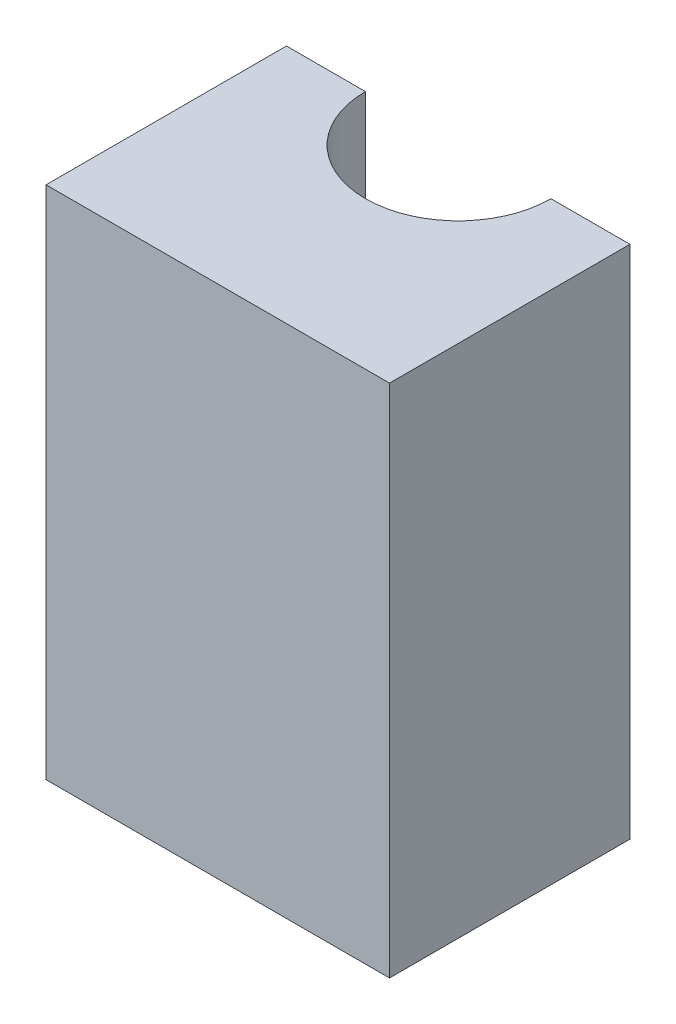
ISO-10303-21;
HEADER;
FILE_DESCRIPTION(('STEP AP214'),'2;1');
FILE_NAME('part.step','',(''),(''),'','','');
FILE_SCHEMA(('AUTOMOTIVE_DESIGN { 1 0 10303 214 1 1 1 1 }'));
ENDSEC;
DATA;
#1=APPLICATION_CONTEXT('core data for automotive mechanical design processes');
#2=APPLICATION_PROTOCOL_DEFINITION('international standard','automotive_design',2000,#1);
#3=PRODUCT_CONTEXT('',#1,'mechanical');
#4=PRODUCT('Part','Part','',(#3));
#5=PRODUCT_RELATED_PRODUCT_CATEGORY('part','',(#4));
#6=PRODUCT_DEFINITION_FORMATION('','',#4);
#7=PRODUCT_DEFINITION_CONTEXT('part definition',#1,'design');
#8=PRODUCT_DEFINITION('design','',#6,#7);
#9=PRODUCT_DEFINITION_SHAPE('','',#8);
#10=(LENGTH_UNIT() NAMED_UNIT(*) SI_UNIT(.MILLI.,.METRE.));
#11=(NAMED_UNIT(*) PLANE_ANGLE_UNIT() SI_UNIT($,.RADIAN.));
#12=(NAMED_UNIT(*) SI_UNIT($,.STERADIAN.) SOLID_ANGLE_UNIT());
#13=UNCERTAINTY_MEASURE_WITH_UNIT(LENGTH_MEASURE(1.E-05),#10,'distance_accuracy_value','');
#14=(GEOMETRIC_REPRESENTATION_CONTEXT(3) GLOBAL_UNCERTAINTY_ASSIGNED_CONTEXT((#13)) GLOBAL_UNIT_ASSIGNED_CONTEXT((#10,
#11,#12)) REPRESENTATION_CONTEXT('',''));
#15=CARTESIAN_POINT('',(0.,0.,0.));
#16=DIRECTION('',(0.,0.,1.));
#17=DIRECTION('',(1.,0.,0.));
#18=AXIS2_PLACEMENT_3D('',#15,#16,#17);
#19=CARTESIAN_POINT('',(5.,15.,3.5));
#20=DIRECTION('',(-1.,0.,0.));
#21=DIRECTION('',(0.,0.,1.));
#22=AXIS2_PLACEMENT_3D('',#19,#20,#21);
#23=PLANE('',#22);
#24=DIRECTION('',(0.,0.,-1.));
#25=VECTOR('',#24,1.);
#26=CARTESIAN_POINT('',(5.,0.,3.5));
#27=LINE('',#26,#25);
#28=CARTESIAN_POINT('',(5.,0.,3.5));
#29=VERTEX_POINT('',#28);
#30=CARTESIAN_POINT('',(5.,0.,-3.5));
#31=VERTEX_POINT('',#30);
#32=EDGE_CURVE('E117',#29,#31,#27,.T.);
#33=ORIENTED_EDGE('',*,*,#32,.T.);
#34=DIRECTION('',(0.,-1.,0.));
#35=VECTOR('',#34,1.);
#36=CARTESIAN_POINT('',(5.,15.,-3.5));
#37=LINE('',#36,#35);
#38=CARTESIAN_POINT('',(5.,15.,-3.5));
#39=VERTEX_POINT('',#38);
#40=EDGE_CURVE('E11',#39,#31,#37,.T.);
#41=ORIENTED_EDGE('',*,*,#40,.F.);
#42=DIRECTION('',(0.,0.,-1.));
#43=VECTOR('',#42,1.);
#44=CARTESIAN_POINT('',(5.,15.,3.5));
#45=LINE('',#44,#43);
#46=CARTESIAN_POINT('',(5.,15.,3.5));
#47=VERTEX_POINT('',#46);
#48=EDGE_CURVE('E127',#47,#39,#45,.T.);
#49=ORIENTED_EDGE('',*,*,#48,.F.);
#50=DIRECTION('',(0.,-1.,0.));
#51=VECTOR('',#50,1.);
#52=CARTESIAN_POINT('',(5.,15.,3.5));
#53=LINE('',#52,#51);
#54=EDGE_CURVE('E113',#47,#29,#53,.T.);
#55=ORIENTED_EDGE('',*,*,#54,.T.);
#56=EDGE_LOOP('',(#33,#41,#49,#55));
#57=FACE_BOUND('',#56,.T.);
#58=ADVANCED_FACE('F33',(#57),#23,.F.);
#59=CARTESIAN_POINT('',(2.7,15.,-3.5));
#60=DIRECTION('',(0.,0.,1.));
#61=DIRECTION('',(1.,0.,0.));
#62=AXIS2_PLACEMENT_3D('',#59,#60,#61);
#63=PLANE('',#62);
#64=DIRECTION('',(-1.,0.,0.));
#65=VECTOR('',#64,1.);
#66=CARTESIAN_POINT('',(2.7,0.,-3.5));
#67=LINE('',#66,#65);
#68=CARTESIAN_POINT('',(2.7,0.,-3.5));
#69=VERTEX_POINT('',#68);
#70=EDGE_CURVE('E120',#31,#69,#67,.T.);
#71=ORIENTED_EDGE('',*,*,#70,.T.);
#72=DIRECTION('',(0.,-1.,0.));
#73=VECTOR('',#72,1.);
#74=CARTESIAN_POINT('',(2.7,15.,-3.5));
#75=LINE('',#74,#73);
#76=CARTESIAN_POINT('',(2.7,15.,-3.5));
#77=VERTEX_POINT('',#76);
#78=EDGE_CURVE('E41',#77,#69,#75,.T.);
#79=ORIENTED_EDGE('',*,*,#78,.F.);
#80=DIRECTION('',(-1.,0.,0.));
#81=VECTOR('',#80,1.);
#82=CARTESIAN_POINT('',(2.7,15.,-3.5));
#83=LINE('',#82,#81);
#84=EDGE_CURVE('E86',#39,#77,#83,.T.);
#85=ORIENTED_EDGE('',*,*,#84,.F.);
#86=ORIENTED_EDGE('',*,*,#40,.T.);
#87=EDGE_LOOP('',(#71,#79,#85,#86));
#88=FACE_BOUND('',#87,.T.);
#89=ADVANCED_FACE('F151',(#88),#63,.F.);
#90=CARTESIAN_POINT('',(0.,15.,-3.5));
#91=DIRECTION('',(0.,-1.,0.));
#92=DIRECTION('',(0.,0.,-1.));
#93=AXIS2_PLACEMENT_3D('',#90,#91,#92);
#94=CYLINDRICAL_SURFACE('',#93,2.7);
#95=CARTESIAN_POINT('',(0.,0.,-3.5));
#96=DIRECTION('',(0.,-1.,0.));
#97=DIRECTION('',(0.,0.,1.));
#98=AXIS2_PLACEMENT_3D('',#95,#96,#97);
#99=CIRCLE('',#98,2.7);
#100=CARTESIAN_POINT('',(-2.7,0.,-3.5));
#101=VERTEX_POINT('',#100);
#102=EDGE_CURVE('E122',#69,#101,#99,.T.);
#103=ORIENTED_EDGE('',*,*,#102,.T.);
#104=DIRECTION('',(0.,-1.,0.));
#105=VECTOR('',#104,1.);
#106=CARTESIAN_POINT('',(-2.7,15.,-3.5));
#107=LINE('',#106,#105);
#108=CARTESIAN_POINT('',(-2.7,15.,-3.5));
#109=VERTEX_POINT('',#108);
#110=EDGE_CURVE('E108',#109,#101,#107,.T.);
#111=ORIENTED_EDGE('',*,*,#110,.F.);
#112=CARTESIAN_POINT('',(0.,15.,-3.5));
#113=DIRECTION('',(0.,-1.,0.));
#114=DIRECTION('',(0.,0.,1.));
#115=AXIS2_PLACEMENT_3D('',#112,#113,#114);
#116=CIRCLE('',#115,2.7);
#117=EDGE_CURVE('E99',#77,#109,#116,.T.);
#118=ORIENTED_EDGE('',*,*,#117,.F.);
#119=ORIENTED_EDGE('',*,*,#78,.T.);
#120=EDGE_LOOP('',(#103,#111,#118,#119));
#121=FACE_BOUND('',#120,.T.);
#122=ADVANCED_FACE('F133',(#121),#94,.F.);
#123=CARTESIAN_POINT('',(-5.,15.,-3.5));
#124=DIRECTION('',(0.,0.,1.));
#125=DIRECTION('',(1.,0.,0.));
#126=AXIS2_PLACEMENT_3D('',#123,#124,#125);
#127=PLANE('',#126);
#128=DIRECTION('',(-1.,0.,0.));
#129=VECTOR('',#128,1.);
#130=CARTESIAN_POINT('',(-5.,0.,-3.5));
#131=LINE('',#130,#129);
#132=CARTESIAN_POINT('',(-5.,0.,-3.5));
#133=VERTEX_POINT('',#132);
#134=EDGE_CURVE('E107',#101,#133,#131,.T.);
#135=ORIENTED_EDGE('',*,*,#134,.T.);
#136=DIRECTION('',(0.,-1.,0.));
#137=VECTOR('',#136,1.);
#138=CARTESIAN_POINT('',(-5.,15.,-3.5));
#139=LINE('',#138,#137);
#140=CARTESIAN_POINT('',(-5.,15.,-3.5));
#141=VERTEX_POINT('',#140);
#142=EDGE_CURVE('E104',#141,#133,#139,.T.);
#143=ORIENTED_EDGE('',*,*,#142,.F.);
#144=DIRECTION('',(-1.,0.,0.));
#145=VECTOR('',#144,1.);
#146=CARTESIAN_POINT('',(-5.,15.,-3.5));
#147=LINE('',#146,#145);
#148=EDGE_CURVE('E93',#109,#141,#147,.T.);
#149=ORIENTED_EDGE('',*,*,#148,.F.);
#150=ORIENTED_EDGE('',*,*,#110,.T.);
#151=EDGE_LOOP('',(#135,#143,#149,#150));
#152=FACE_BOUND('',#151,.T.);
#153=ADVANCED_FACE('F105',(#152),#127,.F.);
#154=CARTESIAN_POINT('',(-5.,15.,3.5));
#155=DIRECTION('',(1.,0.,0.));
#156=DIRECTION('',(0.,0.,-1.));
#157=AXIS2_PLACEMENT_3D('',#154,#155,#156);
#158=PLANE('',#157);
#159=DIRECTION('',(0.,0.,1.));
#160=VECTOR('',#159,1.);
#161=CARTESIAN_POINT('',(-5.,0.,3.5));
#162=LINE('',#161,#160);
#163=CARTESIAN_POINT('',(-5.,0.,3.5));
#164=VERTEX_POINT('',#163);
#165=EDGE_CURVE('E72',#133,#164,#162,.T.);
#166=ORIENTED_EDGE('',*,*,#165,.T.);
#167=DIRECTION('',(0.,-1.,0.));
#168=VECTOR('',#167,1.);
#169=CARTESIAN_POINT('',(-5.,15.,3.5));
#170=LINE('',#169,#168);
#171=CARTESIAN_POINT('',(-5.,15.,3.5));
#172=VERTEX_POINT('',#171);
#173=EDGE_CURVE('E109',#172,#164,#170,.T.);
#174=ORIENTED_EDGE('',*,*,#173,.F.);
#175=DIRECTION('',(0.,0.,1.));
#176=VECTOR('',#175,1.);
#177=CARTESIAN_POINT('',(-5.,15.,3.5));
#178=LINE('',#177,#176);
#179=EDGE_CURVE('E97',#141,#172,#178,.T.);
#180=ORIENTED_EDGE('',*,*,#179,.F.);
#181=ORIENTED_EDGE('',*,*,#142,.T.);
#182=EDGE_LOOP('',(#166,#174,#180,#181));
#183=FACE_BOUND('',#182,.T.);
#184=ADVANCED_FACE('F111',(#183),#158,.F.);
#185=CARTESIAN_POINT('',(-5.,15.,3.5));
#186=DIRECTION('',(0.,0.,-1.));
#187=DIRECTION('',(-1.,0.,0.));
#188=AXIS2_PLACEMENT_3D('',#185,#186,#187);
#189=PLANE('',#188);
#190=DIRECTION('',(1.,0.,0.));
#191=VECTOR('',#190,1.);
#192=CARTESIAN_POINT('',(-5.,0.,3.5));
#193=LINE('',#192,#191);
#194=EDGE_CURVE('E78',#164,#29,#193,.T.);
#195=ORIENTED_EDGE('',*,*,#194,.T.);
#196=ORIENTED_EDGE('',*,*,#54,.F.);
#197=DIRECTION('',(1.,0.,0.));
#198=VECTOR('',#197,1.);
#199=CARTESIAN_POINT('',(-5.,15.,3.5));
#200=LINE('',#199,#198);
#201=EDGE_CURVE('E49',#172,#47,#200,.T.);
#202=ORIENTED_EDGE('',*,*,#201,.F.);
#203=ORIENTED_EDGE('',*,*,#173,.T.);
#204=EDGE_LOOP('',(#195,#196,#202,#203));
#205=FACE_BOUND('',#204,.T.);
#206=ADVANCED_FACE('F140',(#205),#189,.F.);
#207=CARTESIAN_POINT('',(0.,15.,-3.5));
#208=DIRECTION('',(0.,1.,0.));
#209=DIRECTION('',(0.,0.,1.));
#210=AXIS2_PLACEMENT_3D('',#207,#208,#209);
#211=PLANE('',#210);
#212=ORIENTED_EDGE('',*,*,#48,.T.);
#213=ORIENTED_EDGE('',*,*,#84,.T.);
#214=ORIENTED_EDGE('',*,*,#117,.T.);
#215=ORIENTED_EDGE('',*,*,#148,.T.);
#216=ORIENTED_EDGE('',*,*,#179,.T.);
#217=ORIENTED_EDGE('',*,*,#201,.T.);
#218=EDGE_LOOP('',(#212,#213,#214,#215,#216,#217));
#219=FACE_BOUND('',#218,.T.);
#220=ADVANCED_FACE('F95',(#219),#211,.T.);
#221=CARTESIAN_POINT('',(0.,0.,-3.5));
#222=DIRECTION('',(0.,1.,0.));
#223=DIRECTION('',(0.,0.,1.));
#224=AXIS2_PLACEMENT_3D('',#221,#222,#223);
#225=PLANE('',#224);
#226=ORIENTED_EDGE('',*,*,#32,.F.);
#227=ORIENTED_EDGE('',*,*,#194,.F.);
#228=ORIENTED_EDGE('',*,*,#165,.F.);
#229=ORIENTED_EDGE('',*,*,#134,.F.);
#230=ORIENTED_EDGE('',*,*,#102,.F.);
#231=ORIENTED_EDGE('',*,*,#70,.F.);
#232=EDGE_LOOP('',(#226,#227,#228,#229,#230,#231));
#233=FACE_BOUND('',#232,.T.);
#234=ADVANCED_FACE('F136',(#233),#225,.F.);
#235=CLOSED_SHELL('',(#58,#89,#122,#153,#184,#206,#220,#234));
#236=MANIFOLD_SOLID_BREP('B2',#235);
#237=ADVANCED_BREP_SHAPE_REPRESENTATION('',(#18,#236),#14);
#238=SHAPE_DEFINITION_REPRESENTATION(#9,#237);
ENDSEC;
END-ISO-10303-21;
